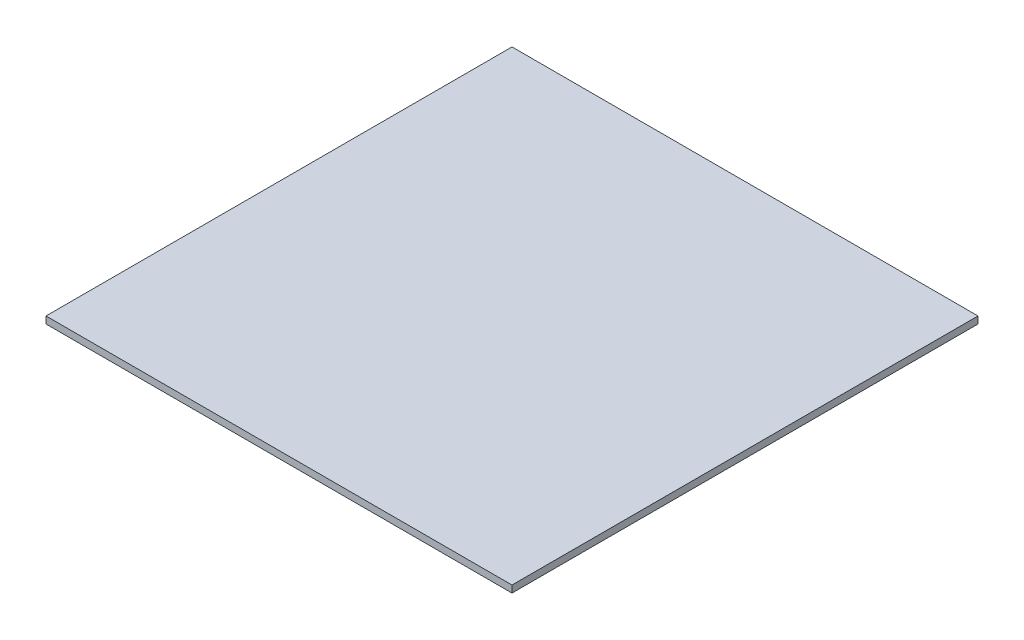
ISO-10303-21;
HEADER;
FILE_DESCRIPTION(('STEP AP214'),'2;1');
FILE_NAME('part.step','',(''),(''),'','','');
FILE_SCHEMA(('AUTOMOTIVE_DESIGN { 1 0 10303 214 1 1 1 1 }'));
ENDSEC;
DATA;
#1=APPLICATION_CONTEXT('core data for automotive mechanical design processes');
#2=APPLICATION_PROTOCOL_DEFINITION('international standard','automotive_design',2000,#1);
#3=PRODUCT_CONTEXT('',#1,'mechanical');
#4=PRODUCT('Part','Part','',(#3));
#5=PRODUCT_RELATED_PRODUCT_CATEGORY('part','',(#4));
#6=PRODUCT_DEFINITION_FORMATION('','',#4);
#7=PRODUCT_DEFINITION_CONTEXT('part definition',#1,'design');
#8=PRODUCT_DEFINITION('design','',#6,#7);
#9=PRODUCT_DEFINITION_SHAPE('','',#8);
#10=(LENGTH_UNIT() NAMED_UNIT(*) SI_UNIT(.MILLI.,.METRE.));
#11=(NAMED_UNIT(*) PLANE_ANGLE_UNIT() SI_UNIT($,.RADIAN.));
#12=(NAMED_UNIT(*) SI_UNIT($,.STERADIAN.) SOLID_ANGLE_UNIT());
#13=UNCERTAINTY_MEASURE_WITH_UNIT(LENGTH_MEASURE(1.E-05),#10,'distance_accuracy_value','');
#14=(GEOMETRIC_REPRESENTATION_CONTEXT(3) GLOBAL_UNCERTAINTY_ASSIGNED_CONTEXT((#13)) GLOBAL_UNIT_ASSIGNED_CONTEXT((#10,
#11,#12)) REPRESENTATION_CONTEXT('',''));
#15=CARTESIAN_POINT('',(0.,0.,0.));
#16=DIRECTION('',(0.,0.,1.));
#17=DIRECTION('',(1.,0.,0.));
#18=AXIS2_PLACEMENT_3D('',#15,#16,#17);
#19=CARTESIAN_POINT('',(100.,3.,-100.));
#20=DIRECTION('',(-1.,0.,0.));
#21=DIRECTION('',(0.,0.,1.));
#22=AXIS2_PLACEMENT_3D('',#19,#20,#21);
#23=PLANE('',#22);
#24=DIRECTION('',(0.,0.,-1.));
#25=VECTOR('',#24,1.);
#26=CARTESIAN_POINT('',(100.,0.,-100.));
#27=LINE('',#26,#25);
#28=CARTESIAN_POINT('',(100.,0.,100.));
#29=VERTEX_POINT('',#28);
#30=CARTESIAN_POINT('',(100.,0.,-100.));
#31=VERTEX_POINT('',#30);
#32=EDGE_CURVE('E96',#29,#31,#27,.T.);
#33=ORIENTED_EDGE('',*,*,#32,.T.);
#34=DIRECTION('',(0.,-1.,0.));
#35=VECTOR('',#34,1.);
#36=CARTESIAN_POINT('',(100.,3.,-100.));
#37=LINE('',#36,#35);
#38=CARTESIAN_POINT('',(100.,3.,-100.));
#39=VERTEX_POINT('',#38);
#40=EDGE_CURVE('E11',#39,#31,#37,.T.);
#41=ORIENTED_EDGE('',*,*,#40,.F.);
#42=DIRECTION('',(0.,0.,-1.));
#43=VECTOR('',#42,1.);
#44=CARTESIAN_POINT('',(100.,3.,-100.));
#45=LINE('',#44,#43);
#46=CARTESIAN_POINT('',(100.,3.,100.));
#47=VERTEX_POINT('',#46);
#48=EDGE_CURVE('E84',#47,#39,#45,.T.);
#49=ORIENTED_EDGE('',*,*,#48,.F.);
#50=DIRECTION('',(0.,-1.,0.));
#51=VECTOR('',#50,1.);
#52=CARTESIAN_POINT('',(100.,3.,100.));
#53=LINE('',#52,#51);
#54=EDGE_CURVE('E92',#47,#29,#53,.T.);
#55=ORIENTED_EDGE('',*,*,#54,.T.);
#56=EDGE_LOOP('',(#33,#41,#49,#55));
#57=FACE_BOUND('',#56,.T.);
#58=ADVANCED_FACE('F33',(#57),#23,.F.);
#59=CARTESIAN_POINT('',(-100.,3.,-100.));
#60=DIRECTION('',(0.,0.,1.));
#61=DIRECTION('',(1.,0.,0.));
#62=AXIS2_PLACEMENT_3D('',#59,#60,#61);
#63=PLANE('',#62);
#64=DIRECTION('',(-1.,0.,0.));
#65=VECTOR('',#64,1.);
#66=CARTESIAN_POINT('',(-100.,0.,-100.));
#67=LINE('',#66,#65);
#68=CARTESIAN_POINT('',(-100.,0.,-100.));
#69=VERTEX_POINT('',#68);
#70=EDGE_CURVE('E88',#31,#69,#67,.T.);
#71=ORIENTED_EDGE('',*,*,#70,.T.);
#72=DIRECTION('',(0.,-1.,0.));
#73=VECTOR('',#72,1.);
#74=CARTESIAN_POINT('',(-100.,3.,-100.));
#75=LINE('',#74,#73);
#76=CARTESIAN_POINT('',(-100.,3.,-100.));
#77=VERTEX_POINT('',#76);
#78=EDGE_CURVE('E41',#77,#69,#75,.T.);
#79=ORIENTED_EDGE('',*,*,#78,.F.);
#80=DIRECTION('',(-1.,0.,0.));
#81=VECTOR('',#80,1.);
#82=CARTESIAN_POINT('',(-100.,3.,-100.));
#83=LINE('',#82,#81);
#84=EDGE_CURVE('E79',#39,#77,#83,.T.);
#85=ORIENTED_EDGE('',*,*,#84,.F.);
#86=ORIENTED_EDGE('',*,*,#40,.T.);
#87=EDGE_LOOP('',(#71,#79,#85,#86));
#88=FACE_BOUND('',#87,.T.);
#89=ADVANCED_FACE('F87',(#88),#63,.F.);
#90=CARTESIAN_POINT('',(-100.,3.,-100.));
#91=DIRECTION('',(1.,0.,0.));
#92=DIRECTION('',(0.,0.,-1.));
#93=AXIS2_PLACEMENT_3D('',#90,#91,#92);
#94=PLANE('',#93);
#95=DIRECTION('',(0.,0.,1.));
#96=VECTOR('',#95,1.);
#97=CARTESIAN_POINT('',(-100.,0.,-100.));
#98=LINE('',#97,#96);
#99=CARTESIAN_POINT('',(-100.,0.,100.));
#100=VERTEX_POINT('',#99);
#101=EDGE_CURVE('E66',#69,#100,#98,.T.);
#102=ORIENTED_EDGE('',*,*,#101,.T.);
#103=DIRECTION('',(0.,-1.,0.));
#104=VECTOR('',#103,1.);
#105=CARTESIAN_POINT('',(-100.,3.,100.));
#106=LINE('',#105,#104);
#107=CARTESIAN_POINT('',(-100.,3.,100.));
#108=VERTEX_POINT('',#107);
#109=EDGE_CURVE('E89',#108,#100,#106,.T.);
#110=ORIENTED_EDGE('',*,*,#109,.F.);
#111=DIRECTION('',(0.,0.,1.));
#112=VECTOR('',#111,1.);
#113=CARTESIAN_POINT('',(-100.,3.,-100.));
#114=LINE('',#113,#112);
#115=EDGE_CURVE('E82',#77,#108,#114,.T.);
#116=ORIENTED_EDGE('',*,*,#115,.F.);
#117=ORIENTED_EDGE('',*,*,#78,.T.);
#118=EDGE_LOOP('',(#102,#110,#116,#117));
#119=FACE_BOUND('',#118,.T.);
#120=ADVANCED_FACE('F90',(#119),#94,.F.);
#121=CARTESIAN_POINT('',(-100.,3.,100.));
#122=DIRECTION('',(0.,0.,-1.));
#123=DIRECTION('',(-1.,0.,0.));
#124=AXIS2_PLACEMENT_3D('',#121,#122,#123);
#125=PLANE('',#124);
#126=DIRECTION('',(1.,0.,0.));
#127=VECTOR('',#126,1.);
#128=CARTESIAN_POINT('',(-100.,0.,100.));
#129=LINE('',#128,#127);
#130=EDGE_CURVE('E72',#100,#29,#129,.T.);
#131=ORIENTED_EDGE('',*,*,#130,.T.);
#132=ORIENTED_EDGE('',*,*,#54,.F.);
#133=DIRECTION('',(1.,0.,0.));
#134=VECTOR('',#133,1.);
#135=CARTESIAN_POINT('',(-100.,3.,100.));
#136=LINE('',#135,#134);
#137=EDGE_CURVE('E49',#108,#47,#136,.T.);
#138=ORIENTED_EDGE('',*,*,#137,.F.);
#139=ORIENTED_EDGE('',*,*,#109,.T.);
#140=EDGE_LOOP('',(#131,#132,#138,#139));
#141=FACE_BOUND('',#140,.T.);
#142=ADVANCED_FACE('F103',(#141),#125,.F.);
#143=CARTESIAN_POINT('',(0.,3.,0.));
#144=DIRECTION('',(0.,1.,0.));
#145=DIRECTION('',(0.,0.,1.));
#146=AXIS2_PLACEMENT_3D('',#143,#144,#145);
#147=PLANE('',#146);
#148=ORIENTED_EDGE('',*,*,#48,.T.);
#149=ORIENTED_EDGE('',*,*,#84,.T.);
#150=ORIENTED_EDGE('',*,*,#115,.T.);
#151=ORIENTED_EDGE('',*,*,#137,.T.);
#152=EDGE_LOOP('',(#148,#149,#150,#151));
#153=FACE_BOUND('',#152,.T.);
#154=ADVANCED_FACE('F80',(#153),#147,.T.);
#155=CARTESIAN_POINT('',(0.,0.,0.));
#156=DIRECTION('',(0.,1.,0.));
#157=DIRECTION('',(0.,0.,1.));
#158=AXIS2_PLACEMENT_3D('',#155,#156,#157);
#159=PLANE('',#158);
#160=ORIENTED_EDGE('',*,*,#32,.F.);
#161=ORIENTED_EDGE('',*,*,#130,.F.);
#162=ORIENTED_EDGE('',*,*,#101,.F.);
#163=ORIENTED_EDGE('',*,*,#70,.F.);
#164=EDGE_LOOP('',(#160,#161,#162,#163));
#165=FACE_BOUND('',#164,.T.);
#166=ADVANCED_FACE('F106',(#165),#159,.F.);
#167=CLOSED_SHELL('',(#58,#89,#120,#142,#154,#166));
#168=MANIFOLD_SOLID_BREP('B2',#167);
#169=ADVANCED_BREP_SHAPE_REPRESENTATION('',(#18,#168),#14);
#170=SHAPE_DEFINITION_REPRESENTATION(#9,#169);
ENDSEC;
END-ISO-10303-21;
